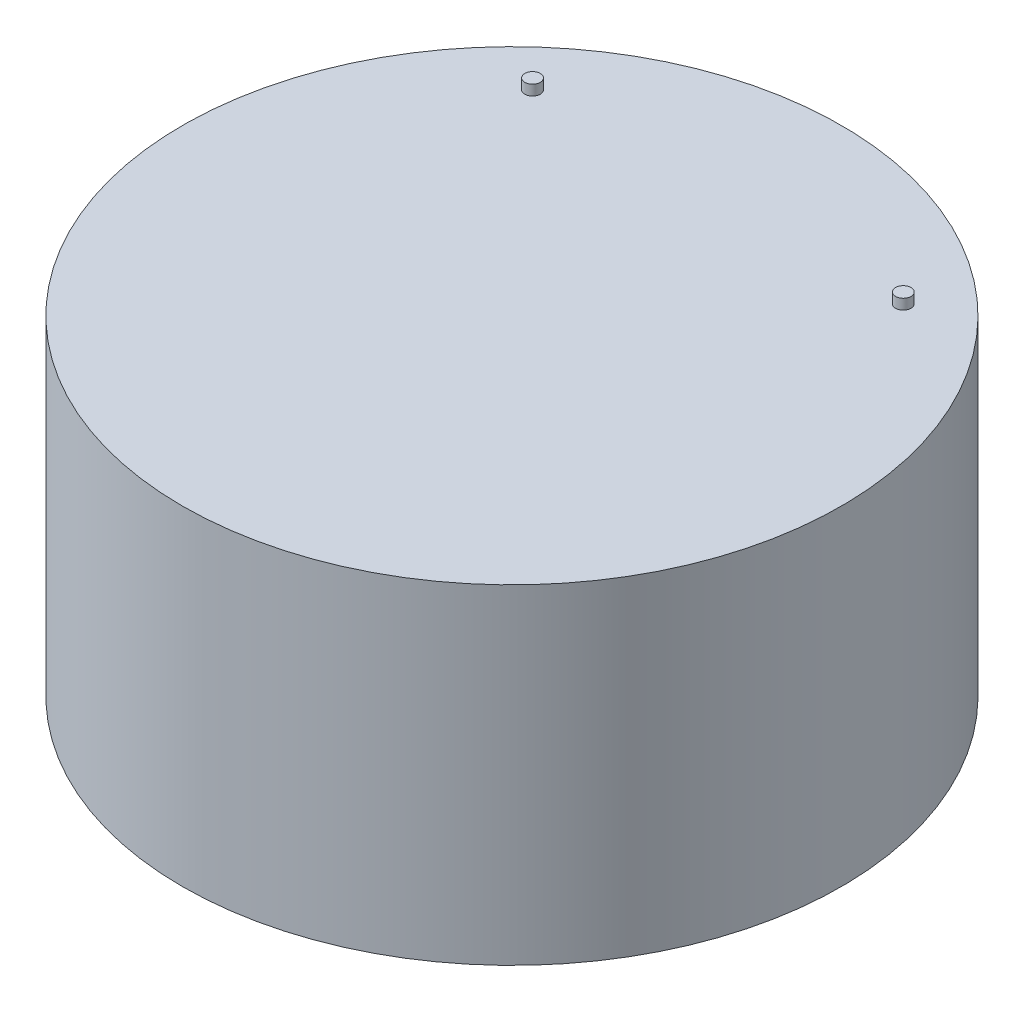
ISO-10303-21;
HEADER;
FILE_DESCRIPTION(('STEP AP214'),'2;1');
FILE_NAME('part.step','',(''),(''),'','','');
FILE_SCHEMA(('AUTOMOTIVE_DESIGN { 1 0 10303 214 1 1 1 1 }'));
ENDSEC;
DATA;
#1=APPLICATION_CONTEXT('core data for automotive mechanical design processes');
#2=APPLICATION_PROTOCOL_DEFINITION('international standard','automotive_design',2000,#1);
#3=PRODUCT_CONTEXT('',#1,'mechanical');
#4=PRODUCT('Part','Part','',(#3));
#5=PRODUCT_RELATED_PRODUCT_CATEGORY('part','',(#4));
#6=PRODUCT_DEFINITION_FORMATION('','',#4);
#7=PRODUCT_DEFINITION_CONTEXT('part definition',#1,'design');
#8=PRODUCT_DEFINITION('design','',#6,#7);
#9=PRODUCT_DEFINITION_SHAPE('','',#8);
#10=(LENGTH_UNIT() NAMED_UNIT(*) SI_UNIT(.MILLI.,.METRE.));
#11=(NAMED_UNIT(*) PLANE_ANGLE_UNIT() SI_UNIT($,.RADIAN.));
#12=(NAMED_UNIT(*) SI_UNIT($,.STERADIAN.) SOLID_ANGLE_UNIT());
#13=UNCERTAINTY_MEASURE_WITH_UNIT(LENGTH_MEASURE(1.E-05),#10,'distance_accuracy_value','');
#14=(GEOMETRIC_REPRESENTATION_CONTEXT(3) GLOBAL_UNCERTAINTY_ASSIGNED_CONTEXT((#13)) GLOBAL_UNIT_ASSIGNED_CONTEXT((#10,
#11,#12)) REPRESENTATION_CONTEXT('',''));
#15=CARTESIAN_POINT('',(0.,0.,0.));
#16=DIRECTION('',(0.,0.,1.));
#17=DIRECTION('',(1.,0.,0.));
#18=AXIS2_PLACEMENT_3D('',#15,#16,#17);
#19=CARTESIAN_POINT('',(0.,50.8,0.));
#20=DIRECTION('',(0.,1.,0.));
#21=DIRECTION('',(0.,0.,1.));
#22=AXIS2_PLACEMENT_3D('',#19,#20,#21);
#23=PLANE('',#22);
#24=CARTESIAN_POINT('',(28.575,50.8,-31.75));
#25=DIRECTION('',(0.,1.,0.));
#26=DIRECTION('',(0.,0.,1.));
#27=AXIS2_PLACEMENT_3D('',#24,#25,#26);
#28=CIRCLE('',#27,1.190625);
#29=CARTESIAN_POINT('',(28.575,50.8,-30.559375));
#30=VERTEX_POINT('',#29);
#31=EDGE_CURVE('E46',#30,#30,#28,.T.);
#32=ORIENTED_EDGE('',*,*,#31,.F.);
#33=EDGE_LOOP('',(#32));
#34=FACE_BOUND('',#33,.T.);
#35=CARTESIAN_POINT('',(0.,50.8,0.));
#36=DIRECTION('',(0.,1.,0.));
#37=DIRECTION('',(0.,0.,1.));
#38=AXIS2_PLACEMENT_3D('',#35,#36,#37);
#39=CIRCLE('',#38,50.8);
#40=CARTESIAN_POINT('',(0.,50.8,50.8));
#41=VERTEX_POINT('',#40);
#42=EDGE_CURVE('E10',#41,#41,#39,.T.);
#43=ORIENTED_EDGE('',*,*,#42,.T.);
#44=EDGE_LOOP('',(#43));
#45=FACE_BOUND('',#44,.T.);
#46=CARTESIAN_POINT('',(-28.575,50.8,-31.75));
#47=DIRECTION('',(0.,1.,0.));
#48=DIRECTION('',(0.,0.,-1.));
#49=AXIS2_PLACEMENT_3D('',#46,#47,#48);
#50=CIRCLE('',#49,1.190625);
#51=CARTESIAN_POINT('',(-28.575,50.8,-32.940625));
#52=VERTEX_POINT('',#51);
#53=EDGE_CURVE('E52',#52,#52,#50,.T.);
#54=ORIENTED_EDGE('',*,*,#53,.F.);
#55=EDGE_LOOP('',(#54));
#56=FACE_BOUND('',#55,.T.);
#57=ADVANCED_FACE('F33',(#34,#45,#56),#23,.T.);
#58=CARTESIAN_POINT('',(0.,50.8,0.));
#59=DIRECTION('',(0.,-1.,0.));
#60=DIRECTION('',(0.,0.,-1.));
#61=AXIS2_PLACEMENT_3D('',#58,#59,#60);
#62=CYLINDRICAL_SURFACE('',#61,50.8);
#63=ORIENTED_EDGE('',*,*,#42,.F.);
#64=EDGE_LOOP('',(#63));
#65=FACE_BOUND('',#64,.T.);
#66=CARTESIAN_POINT('',(0.,0.,0.));
#67=DIRECTION('',(0.,1.,0.));
#68=DIRECTION('',(0.,0.,1.));
#69=AXIS2_PLACEMENT_3D('',#66,#67,#68);
#70=CIRCLE('',#69,50.8);
#71=CARTESIAN_POINT('',(0.,0.,50.8));
#72=VERTEX_POINT('',#71);
#73=EDGE_CURVE('E37',#72,#72,#70,.T.);
#74=ORIENTED_EDGE('',*,*,#73,.T.);
#75=EDGE_LOOP('',(#74));
#76=FACE_BOUND('',#75,.T.);
#77=ADVANCED_FACE('F35',(#65,#76),#62,.T.);
#78=CARTESIAN_POINT('',(0.,0.,0.));
#79=DIRECTION('',(0.,1.,0.));
#80=DIRECTION('',(0.,0.,1.));
#81=AXIS2_PLACEMENT_3D('',#78,#79,#80);
#82=PLANE('',#81);
#83=ORIENTED_EDGE('',*,*,#73,.F.);
#84=EDGE_LOOP('',(#83));
#85=FACE_BOUND('',#84,.T.);
#86=ADVANCED_FACE('F73',(#85),#82,.F.);
#87=CARTESIAN_POINT('',(28.575,52.388262,-31.75));
#88=DIRECTION('',(0.,-1.,0.));
#89=DIRECTION('',(0.,0.,-1.));
#90=AXIS2_PLACEMENT_3D('',#87,#88,#89);
#91=CYLINDRICAL_SURFACE('',#90,1.190625);
#92=CARTESIAN_POINT('',(28.575,52.388262,-31.75));
#93=DIRECTION('',(0.,1.,0.));
#94=DIRECTION('',(0.,0.,1.));
#95=AXIS2_PLACEMENT_3D('',#92,#93,#94);
#96=CIRCLE('',#95,1.190625);
#97=CARTESIAN_POINT('',(28.575,52.388262,-30.559375));
#98=VERTEX_POINT('',#97);
#99=EDGE_CURVE('E44',#98,#98,#96,.T.);
#100=ORIENTED_EDGE('',*,*,#99,.F.);
#101=EDGE_LOOP('',(#100));
#102=FACE_BOUND('',#101,.T.);
#103=ORIENTED_EDGE('',*,*,#31,.T.);
#104=EDGE_LOOP('',(#103));
#105=FACE_BOUND('',#104,.T.);
#106=ADVANCED_FACE('F77',(#102,#105),#91,.T.);
#107=CARTESIAN_POINT('',(28.575,52.388262,-31.75));
#108=DIRECTION('',(0.,1.,0.));
#109=DIRECTION('',(0.,0.,1.));
#110=AXIS2_PLACEMENT_3D('',#107,#108,#109);
#111=PLANE('',#110);
#112=ORIENTED_EDGE('',*,*,#99,.T.);
#113=EDGE_LOOP('',(#112));
#114=FACE_BOUND('',#113,.T.);
#115=ADVANCED_FACE('F63',(#114),#111,.T.);
#116=CARTESIAN_POINT('',(-28.575,52.388262,-31.75));
#117=DIRECTION('',(0.,-1.,0.));
#118=DIRECTION('',(0.,0.,-1.));
#119=AXIS2_PLACEMENT_3D('',#116,#117,#118);
#120=CYLINDRICAL_SURFACE('',#119,1.190625);
#121=CARTESIAN_POINT('',(-28.575,52.388262,-31.75));
#122=DIRECTION('',(0.,1.,0.));
#123=DIRECTION('',(0.,0.,-1.));
#124=AXIS2_PLACEMENT_3D('',#121,#122,#123);
#125=CIRCLE('',#124,1.190625);
#126=CARTESIAN_POINT('',(-28.575,52.388262,-32.940625));
#127=VERTEX_POINT('',#126);
#128=EDGE_CURVE('E49',#127,#127,#125,.T.);
#129=ORIENTED_EDGE('',*,*,#128,.F.);
#130=EDGE_LOOP('',(#129));
#131=FACE_BOUND('',#130,.T.);
#132=ORIENTED_EDGE('',*,*,#53,.T.);
#133=EDGE_LOOP('',(#132));
#134=FACE_BOUND('',#133,.T.);
#135=ADVANCED_FACE('F60',(#131,#134),#120,.T.);
#136=CARTESIAN_POINT('',(-28.575,52.388262,-31.75));
#137=DIRECTION('',(0.,-1.,0.));
#138=DIRECTION('',(0.,0.,-1.));
#139=AXIS2_PLACEMENT_3D('',#136,#137,#138);
#140=PLANE('',#139);
#141=ORIENTED_EDGE('',*,*,#128,.T.);
#142=EDGE_LOOP('',(#141));
#143=FACE_BOUND('',#142,.T.);
#144=ADVANCED_FACE('F58',(#143),#140,.F.);
#145=CLOSED_SHELL('',(#57,#77,#86,#106,#115,#135,#144));
#146=MANIFOLD_SOLID_BREP('B2',#145);
#147=ADVANCED_BREP_SHAPE_REPRESENTATION('',(#18,#146),#14);
#148=SHAPE_DEFINITION_REPRESENTATION(#9,#147);
ENDSEC;
END-ISO-10303-21;
